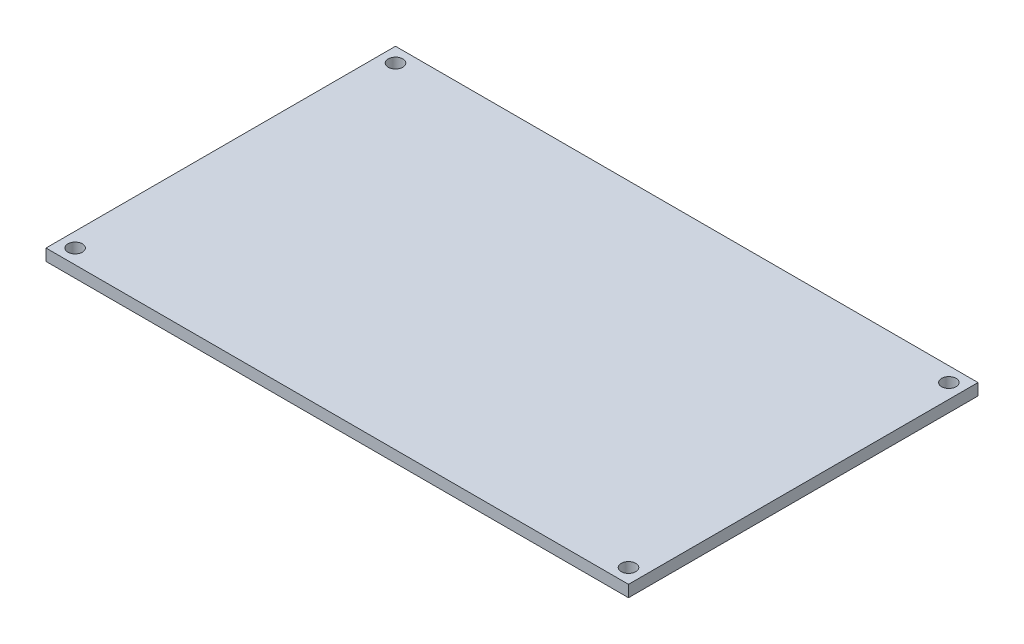
ISO-10303-21;
HEADER;
FILE_DESCRIPTION(('STEP AP214'),'2;1');
FILE_NAME('part.step','',(''),(''),'','','');
FILE_SCHEMA(('AUTOMOTIVE_DESIGN { 1 0 10303 214 1 1 1 1 }'));
ENDSEC;
DATA;
#1=APPLICATION_CONTEXT('core data for automotive mechanical design processes');
#2=APPLICATION_PROTOCOL_DEFINITION('international standard','automotive_design',2000,#1);
#3=PRODUCT_CONTEXT('',#1,'mechanical');
#4=PRODUCT('Part','Part','',(#3));
#5=PRODUCT_RELATED_PRODUCT_CATEGORY('part','',(#4));
#6=PRODUCT_DEFINITION_FORMATION('','',#4);
#7=PRODUCT_DEFINITION_CONTEXT('part definition',#1,'design');
#8=PRODUCT_DEFINITION('design','',#6,#7);
#9=PRODUCT_DEFINITION_SHAPE('','',#8);
#10=(LENGTH_UNIT() NAMED_UNIT(*) SI_UNIT(.MILLI.,.METRE.));
#11=(NAMED_UNIT(*) PLANE_ANGLE_UNIT() SI_UNIT($,.RADIAN.));
#12=(NAMED_UNIT(*) SI_UNIT($,.STERADIAN.) SOLID_ANGLE_UNIT());
#13=UNCERTAINTY_MEASURE_WITH_UNIT(LENGTH_MEASURE(1.E-05),#10,'distance_accuracy_value','');
#14=(GEOMETRIC_REPRESENTATION_CONTEXT(3) GLOBAL_UNCERTAINTY_ASSIGNED_CONTEXT((#13)) GLOBAL_UNIT_ASSIGNED_CONTEXT((#10,
#11,#12)) REPRESENTATION_CONTEXT('',''));
#15=CARTESIAN_POINT('',(0.,0.,0.));
#16=DIRECTION('',(0.,0.,1.));
#17=DIRECTION('',(1.,0.,0.));
#18=AXIS2_PLACEMENT_3D('',#15,#16,#17);
#19=CARTESIAN_POINT('',(-100.,4.,-60.));
#20=DIRECTION('',(1.,0.,0.));
#21=DIRECTION('',(0.,0.,-1.));
#22=AXIS2_PLACEMENT_3D('',#19,#20,#21);
#23=PLANE('',#22);
#24=DIRECTION('',(0.,0.,1.));
#25=VECTOR('',#24,1.);
#26=CARTESIAN_POINT('',(-100.,0.,-60.));
#27=LINE('',#26,#25);
#28=CARTESIAN_POINT('',(-100.,0.,-60.));
#29=VERTEX_POINT('',#28);
#30=CARTESIAN_POINT('',(-100.,0.,60.));
#31=VERTEX_POINT('',#30);
#32=EDGE_CURVE('E109',#29,#31,#27,.T.);
#33=ORIENTED_EDGE('',*,*,#32,.T.);
#34=DIRECTION('',(0.,-1.,0.));
#35=VECTOR('',#34,1.);
#36=CARTESIAN_POINT('',(-100.,4.,60.));
#37=LINE('',#36,#35);
#38=CARTESIAN_POINT('',(-100.,4.,60.));
#39=VERTEX_POINT('',#38);
#40=EDGE_CURVE('E11',#39,#31,#37,.T.);
#41=ORIENTED_EDGE('',*,*,#40,.F.);
#42=DIRECTION('',(0.,0.,1.));
#43=VECTOR('',#42,1.);
#44=CARTESIAN_POINT('',(-100.,4.,-60.));
#45=LINE('',#44,#43);
#46=CARTESIAN_POINT('',(-100.,4.,-60.));
#47=VERTEX_POINT('',#46);
#48=EDGE_CURVE('E93',#47,#39,#45,.T.);
#49=ORIENTED_EDGE('',*,*,#48,.F.);
#50=DIRECTION('',(0.,-1.,0.));
#51=VECTOR('',#50,1.);
#52=CARTESIAN_POINT('',(-100.,4.,-60.));
#53=LINE('',#52,#51);
#54=EDGE_CURVE('E105',#47,#29,#53,.T.);
#55=ORIENTED_EDGE('',*,*,#54,.T.);
#56=EDGE_LOOP('',(#33,#41,#49,#55));
#57=FACE_BOUND('',#56,.T.);
#58=ADVANCED_FACE('F41',(#57),#23,.F.);
#59=CARTESIAN_POINT('',(100.,4.,60.));
#60=DIRECTION('',(0.,0.,-1.));
#61=DIRECTION('',(-1.,0.,0.));
#62=AXIS2_PLACEMENT_3D('',#59,#60,#61);
#63=PLANE('',#62);
#64=DIRECTION('',(1.,0.,0.));
#65=VECTOR('',#64,1.);
#66=CARTESIAN_POINT('',(100.,0.,60.));
#67=LINE('',#66,#65);
#68=CARTESIAN_POINT('',(100.,0.,60.));
#69=VERTEX_POINT('',#68);
#70=EDGE_CURVE('E98',#31,#69,#67,.T.);
#71=ORIENTED_EDGE('',*,*,#70,.T.);
#72=DIRECTION('',(0.,-1.,0.));
#73=VECTOR('',#72,1.);
#74=CARTESIAN_POINT('',(100.,4.,60.));
#75=LINE('',#74,#73);
#76=CARTESIAN_POINT('',(100.,4.,60.));
#77=VERTEX_POINT('',#76);
#78=EDGE_CURVE('E50',#77,#69,#75,.T.);
#79=ORIENTED_EDGE('',*,*,#78,.F.);
#80=DIRECTION('',(1.,0.,0.));
#81=VECTOR('',#80,1.);
#82=CARTESIAN_POINT('',(100.,4.,60.));
#83=LINE('',#82,#81);
#84=EDGE_CURVE('E88',#39,#77,#83,.T.);
#85=ORIENTED_EDGE('',*,*,#84,.F.);
#86=ORIENTED_EDGE('',*,*,#40,.T.);
#87=EDGE_LOOP('',(#71,#79,#85,#86));
#88=FACE_BOUND('',#87,.T.);
#89=ADVANCED_FACE('F97',(#88),#63,.F.);
#90=CARTESIAN_POINT('',(100.,4.,-60.));
#91=DIRECTION('',(-1.,0.,0.));
#92=DIRECTION('',(0.,0.,1.));
#93=AXIS2_PLACEMENT_3D('',#90,#91,#92);
#94=PLANE('',#93);
#95=DIRECTION('',(0.,0.,-1.));
#96=VECTOR('',#95,1.);
#97=CARTESIAN_POINT('',(100.,0.,-60.));
#98=LINE('',#97,#96);
#99=CARTESIAN_POINT('',(100.,0.,-60.));
#100=VERTEX_POINT('',#99);
#101=EDGE_CURVE('E75',#69,#100,#98,.T.);
#102=ORIENTED_EDGE('',*,*,#101,.T.);
#103=DIRECTION('',(0.,-1.,0.));
#104=VECTOR('',#103,1.);
#105=CARTESIAN_POINT('',(100.,4.,-60.));
#106=LINE('',#105,#104);
#107=CARTESIAN_POINT('',(100.,4.,-60.));
#108=VERTEX_POINT('',#107);
#109=EDGE_CURVE('E100',#108,#100,#106,.T.);
#110=ORIENTED_EDGE('',*,*,#109,.F.);
#111=DIRECTION('',(0.,0.,-1.));
#112=VECTOR('',#111,1.);
#113=CARTESIAN_POINT('',(100.,4.,-60.));
#114=LINE('',#113,#112);
#115=EDGE_CURVE('E91',#77,#108,#114,.T.);
#116=ORIENTED_EDGE('',*,*,#115,.F.);
#117=ORIENTED_EDGE('',*,*,#78,.T.);
#118=EDGE_LOOP('',(#102,#110,#116,#117));
#119=FACE_BOUND('',#118,.T.);
#120=ADVANCED_FACE('F101',(#119),#94,.F.);
#121=CARTESIAN_POINT('',(100.,4.,-60.));
#122=DIRECTION('',(0.,0.,1.));
#123=DIRECTION('',(1.,0.,0.));
#124=AXIS2_PLACEMENT_3D('',#121,#122,#123);
#125=PLANE('',#124);
#126=DIRECTION('',(-1.,0.,0.));
#127=VECTOR('',#126,1.);
#128=CARTESIAN_POINT('',(100.,0.,-60.));
#129=LINE('',#128,#127);
#130=EDGE_CURVE('E81',#100,#29,#129,.T.);
#131=ORIENTED_EDGE('',*,*,#130,.T.);
#132=ORIENTED_EDGE('',*,*,#54,.F.);
#133=DIRECTION('',(-1.,0.,0.));
#134=VECTOR('',#133,1.);
#135=CARTESIAN_POINT('',(100.,4.,-60.));
#136=LINE('',#135,#134);
#137=EDGE_CURVE('E58',#108,#47,#136,.T.);
#138=ORIENTED_EDGE('',*,*,#137,.F.);
#139=ORIENTED_EDGE('',*,*,#109,.T.);
#140=EDGE_LOOP('',(#131,#132,#138,#139));
#141=FACE_BOUND('',#140,.T.);
#142=ADVANCED_FACE('F123',(#141),#125,.F.);
#143=CARTESIAN_POINT('',(0.,4.,0.));
#144=DIRECTION('',(0.,-1.,0.));
#145=DIRECTION('',(0.,0.,-1.));
#146=AXIS2_PLACEMENT_3D('',#143,#144,#145);
#147=PLANE('',#146);
#148=CARTESIAN_POINT('',(-95.,4.,-55.));
#149=DIRECTION('',(0.,1.,0.));
#150=DIRECTION('',(0.,0.,1.));
#151=AXIS2_PLACEMENT_3D('',#148,#149,#150);
#152=CIRCLE('',#151,2.5);
#153=CARTESIAN_POINT('',(-95.,4.,-52.5));
#154=VERTEX_POINT('',#153);
#155=EDGE_CURVE('E157',#154,#154,#152,.T.);
#156=ORIENTED_EDGE('',*,*,#155,.F.);
#157=EDGE_LOOP('',(#156));
#158=FACE_BOUND('',#157,.T.);
#159=CARTESIAN_POINT('',(-95.,4.,55.));
#160=DIRECTION('',(0.,1.,0.));
#161=DIRECTION('',(0.,0.,1.));
#162=AXIS2_PLACEMENT_3D('',#159,#160,#161);
#163=CIRCLE('',#162,2.5);
#164=CARTESIAN_POINT('',(-95.,4.,57.5));
#165=VERTEX_POINT('',#164);
#166=EDGE_CURVE('E149',#165,#165,#163,.T.);
#167=ORIENTED_EDGE('',*,*,#166,.F.);
#168=EDGE_LOOP('',(#167));
#169=FACE_BOUND('',#168,.T.);
#170=CARTESIAN_POINT('',(95.,4.,55.));
#171=DIRECTION('',(0.,1.,0.));
#172=DIRECTION('',(0.,0.,1.));
#173=AXIS2_PLACEMENT_3D('',#170,#171,#172);
#174=CIRCLE('',#173,2.5);
#175=CARTESIAN_POINT('',(95.,4.,57.5));
#176=VERTEX_POINT('',#175);
#177=EDGE_CURVE('E141',#176,#176,#174,.T.);
#178=ORIENTED_EDGE('',*,*,#177,.F.);
#179=EDGE_LOOP('',(#178));
#180=FACE_BOUND('',#179,.T.);
#181=CARTESIAN_POINT('',(95.,4.,-55.));
#182=DIRECTION('',(0.,1.,0.));
#183=DIRECTION('',(0.,0.,1.));
#184=AXIS2_PLACEMENT_3D('',#181,#182,#183);
#185=CIRCLE('',#184,2.5);
#186=CARTESIAN_POINT('',(95.,4.,-52.5));
#187=VERTEX_POINT('',#186);
#188=EDGE_CURVE('E133',#187,#187,#185,.T.);
#189=ORIENTED_EDGE('',*,*,#188,.F.);
#190=EDGE_LOOP('',(#189));
#191=FACE_BOUND('',#190,.T.);
#192=ORIENTED_EDGE('',*,*,#48,.T.);
#193=ORIENTED_EDGE('',*,*,#84,.T.);
#194=ORIENTED_EDGE('',*,*,#115,.T.);
#195=ORIENTED_EDGE('',*,*,#137,.T.);
#196=EDGE_LOOP('',(#192,#193,#194,#195));
#197=FACE_BOUND('',#196,.T.);
#198=ADVANCED_FACE('F89',(#158,#169,#180,#191,#197),#147,.F.);
#199=CARTESIAN_POINT('',(0.,0.,0.));
#200=DIRECTION('',(0.,-1.,0.));
#201=DIRECTION('',(0.,0.,-1.));
#202=AXIS2_PLACEMENT_3D('',#199,#200,#201);
#203=PLANE('',#202);
#204=CARTESIAN_POINT('',(-95.,0.,-55.));
#205=DIRECTION('',(0.,-1.,0.));
#206=DIRECTION('',(0.,0.,-1.));
#207=AXIS2_PLACEMENT_3D('',#204,#205,#206);
#208=CIRCLE('',#207,2.5);
#209=CARTESIAN_POINT('',(-95.,0.,-57.5));
#210=VERTEX_POINT('',#209);
#211=EDGE_CURVE('E153',#210,#210,#208,.T.);
#212=ORIENTED_EDGE('',*,*,#211,.F.);
#213=EDGE_LOOP('',(#212));
#214=FACE_BOUND('',#213,.T.);
#215=CARTESIAN_POINT('',(-95.,0.,55.));
#216=DIRECTION('',(0.,-1.,0.));
#217=DIRECTION('',(0.,0.,-1.));
#218=AXIS2_PLACEMENT_3D('',#215,#216,#217);
#219=CIRCLE('',#218,2.5);
#220=CARTESIAN_POINT('',(-95.,0.,52.5));
#221=VERTEX_POINT('',#220);
#222=EDGE_CURVE('E145',#221,#221,#219,.T.);
#223=ORIENTED_EDGE('',*,*,#222,.F.);
#224=EDGE_LOOP('',(#223));
#225=FACE_BOUND('',#224,.T.);
#226=CARTESIAN_POINT('',(95.,0.,55.));
#227=DIRECTION('',(0.,-1.,0.));
#228=DIRECTION('',(0.,0.,-1.));
#229=AXIS2_PLACEMENT_3D('',#226,#227,#228);
#230=CIRCLE('',#229,2.5);
#231=CARTESIAN_POINT('',(95.,0.,52.5));
#232=VERTEX_POINT('',#231);
#233=EDGE_CURVE('E137',#232,#232,#230,.T.);
#234=ORIENTED_EDGE('',*,*,#233,.F.);
#235=EDGE_LOOP('',(#234));
#236=FACE_BOUND('',#235,.T.);
#237=CARTESIAN_POINT('',(95.,0.,-55.));
#238=DIRECTION('',(0.,-1.,0.));
#239=DIRECTION('',(0.,0.,-1.));
#240=AXIS2_PLACEMENT_3D('',#237,#238,#239);
#241=CIRCLE('',#240,2.5);
#242=CARTESIAN_POINT('',(95.,0.,-57.5));
#243=VERTEX_POINT('',#242);
#244=EDGE_CURVE('E113',#243,#243,#241,.T.);
#245=ORIENTED_EDGE('',*,*,#244,.F.);
#246=EDGE_LOOP('',(#245));
#247=FACE_BOUND('',#246,.T.);
#248=ORIENTED_EDGE('',*,*,#32,.F.);
#249=ORIENTED_EDGE('',*,*,#130,.F.);
#250=ORIENTED_EDGE('',*,*,#101,.F.);
#251=ORIENTED_EDGE('',*,*,#70,.F.);
#252=EDGE_LOOP('',(#248,#249,#250,#251));
#253=FACE_BOUND('',#252,.T.);
#254=ADVANCED_FACE('F126',(#214,#225,#236,#247,#253),#203,.T.);
#255=CARTESIAN_POINT('',(95.,4.,-55.));
#256=DIRECTION('',(0.,1.,0.));
#257=DIRECTION('',(0.,0.,1.));
#258=AXIS2_PLACEMENT_3D('',#255,#256,#257);
#259=CYLINDRICAL_SURFACE('',#258,2.5);
#260=ORIENTED_EDGE('',*,*,#244,.T.);
#261=EDGE_LOOP('',(#260));
#262=FACE_BOUND('',#261,.T.);
#263=ORIENTED_EDGE('',*,*,#188,.T.);
#264=EDGE_LOOP('',(#263));
#265=FACE_BOUND('',#264,.T.);
#266=ADVANCED_FACE('F173',(#262,#265),#259,.F.);
#267=CARTESIAN_POINT('',(95.,4.,55.));
#268=DIRECTION('',(0.,1.,0.));
#269=DIRECTION('',(0.,0.,1.));
#270=AXIS2_PLACEMENT_3D('',#267,#268,#269);
#271=CYLINDRICAL_SURFACE('',#270,2.5);
#272=ORIENTED_EDGE('',*,*,#233,.T.);
#273=EDGE_LOOP('',(#272));
#274=FACE_BOUND('',#273,.T.);
#275=ORIENTED_EDGE('',*,*,#177,.T.);
#276=EDGE_LOOP('',(#275));
#277=FACE_BOUND('',#276,.T.);
#278=ADVANCED_FACE('F175',(#274,#277),#271,.F.);
#279=CARTESIAN_POINT('',(-95.,4.,55.));
#280=DIRECTION('',(0.,1.,0.));
#281=DIRECTION('',(0.,0.,1.));
#282=AXIS2_PLACEMENT_3D('',#279,#280,#281);
#283=CYLINDRICAL_SURFACE('',#282,2.5);
#284=ORIENTED_EDGE('',*,*,#222,.T.);
#285=EDGE_LOOP('',(#284));
#286=FACE_BOUND('',#285,.T.);
#287=ORIENTED_EDGE('',*,*,#166,.T.);
#288=EDGE_LOOP('',(#287));
#289=FACE_BOUND('',#288,.T.);
#290=ADVANCED_FACE('F182',(#286,#289),#283,.F.);
#291=CARTESIAN_POINT('',(-95.,4.,-55.));
#292=DIRECTION('',(0.,1.,0.));
#293=DIRECTION('',(0.,0.,1.));
#294=AXIS2_PLACEMENT_3D('',#291,#292,#293);
#295=CYLINDRICAL_SURFACE('',#294,2.5);
#296=ORIENTED_EDGE('',*,*,#211,.T.);
#297=EDGE_LOOP('',(#296));
#298=FACE_BOUND('',#297,.T.);
#299=ORIENTED_EDGE('',*,*,#155,.T.);
#300=EDGE_LOOP('',(#299));
#301=FACE_BOUND('',#300,.T.);
#302=ADVANCED_FACE('F162',(#298,#301),#295,.F.);
#303=CLOSED_SHELL('',(#58,#89,#120,#142,#198,#254,#266,#278,#290,#302));
#304=MANIFOLD_SOLID_BREP('B2',#303);
#305=ADVANCED_BREP_SHAPE_REPRESENTATION('',(#18,#304),#14);
#306=SHAPE_DEFINITION_REPRESENTATION(#9,#305);
ENDSEC;
END-ISO-10303-21;
